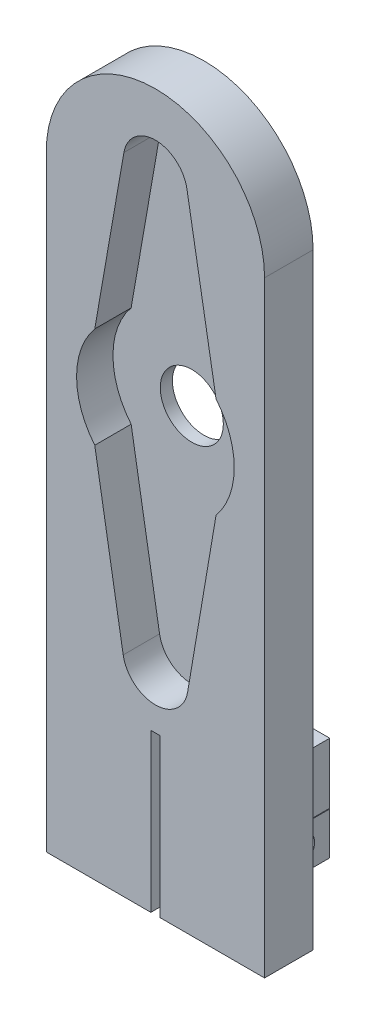
ISO-10303-21;
HEADER;
FILE_DESCRIPTION(('STEP AP214'),'2;1');
FILE_NAME('part.step','',(''),(''),'','','');
FILE_SCHEMA(('AUTOMOTIVE_DESIGN { 1 0 10303 214 1 1 1 1 }'));
ENDSEC;
DATA;
#1=APPLICATION_CONTEXT('core data for automotive mechanical design processes');
#2=APPLICATION_PROTOCOL_DEFINITION('international standard','automotive_design',2000,#1);
#3=PRODUCT_CONTEXT('',#1,'mechanical');
#4=PRODUCT('Part','Part','',(#3));
#5=PRODUCT_RELATED_PRODUCT_CATEGORY('part','',(#4));
#6=PRODUCT_DEFINITION_FORMATION('','',#4);
#7=PRODUCT_DEFINITION_CONTEXT('part definition',#1,'design');
#8=PRODUCT_DEFINITION('design','',#6,#7);
#9=PRODUCT_DEFINITION_SHAPE('','',#8);
#10=(LENGTH_UNIT() NAMED_UNIT(*) SI_UNIT(.MILLI.,.METRE.));
#11=(NAMED_UNIT(*) PLANE_ANGLE_UNIT() SI_UNIT($,.RADIAN.));
#12=(NAMED_UNIT(*) SI_UNIT($,.STERADIAN.) SOLID_ANGLE_UNIT());
#13=UNCERTAINTY_MEASURE_WITH_UNIT(LENGTH_MEASURE(1.E-05),#10,'distance_accuracy_value','');
#14=(GEOMETRIC_REPRESENTATION_CONTEXT(3) GLOBAL_UNCERTAINTY_ASSIGNED_CONTEXT((#13)) GLOBAL_UNIT_ASSIGNED_CONTEXT((#10,
#11,#12)) REPRESENTATION_CONTEXT('',''));
#15=CARTESIAN_POINT('',(0.,0.,0.));
#16=DIRECTION('',(0.,0.,1.));
#17=DIRECTION('',(1.,0.,0.));
#18=AXIS2_PLACEMENT_3D('',#15,#16,#17);
#19=CARTESIAN_POINT('',(0.,50.,0.));
#20=DIRECTION('',(0.,0.,-1.));
#21=DIRECTION('',(-1.,0.,0.));
#22=AXIS2_PLACEMENT_3D('',#19,#20,#21);
#23=PLANE('',#22);
#24=CARTESIAN_POINT('',(0.,34.8563142161993,0.));
#25=DIRECTION('',(0.,0.,-1.));
#26=DIRECTION('',(-1.,0.,0.));
#27=AXIS2_PLACEMENT_3D('',#24,#25,#26);
#28=CIRCLE('',#27,2.6);
#29=CARTESIAN_POINT('',(-2.6,34.8563142161993,0.));
#30=VERTEX_POINT('',#29);
#31=EDGE_CURVE('E299',#30,#30,#28,.F.);
#32=ORIENTED_EDGE('',*,*,#31,.T.);
#33=EDGE_LOOP('',(#32));
#34=FACE_BOUND('',#33,.T.);
#35=DIRECTION('',(0.,1.,0.));
#36=VECTOR('',#35,1.);
#37=CARTESIAN_POINT('',(0.375,0.,0.));
#38=LINE('',#37,#36);
#39=CARTESIAN_POINT('',(0.375,0.,0.));
#40=VERTEX_POINT('',#39);
#41=CARTESIAN_POINT('',(0.375,2.2621640661949,0.));
#42=VERTEX_POINT('',#41);
#43=EDGE_CURVE('E281',#40,#42,#38,.T.);
#44=ORIENTED_EDGE('',*,*,#43,.T.);
#45=DIRECTION('',(-1.,0.,0.));
#46=VECTOR('',#45,1.);
#47=CARTESIAN_POINT('',(5.375,2.2621640661949,0.));
#48=LINE('',#47,#46);
#49=CARTESIAN_POINT('',(5.375,2.2621640661949,0.));
#50=VERTEX_POINT('',#49);
#51=EDGE_CURVE('E55',#50,#42,#48,.T.);
#52=ORIENTED_EDGE('',*,*,#51,.F.);
#53=DIRECTION('',(0.,-1.,0.));
#54=VECTOR('',#53,1.);
#55=CARTESIAN_POINT('',(5.375,5.7621640661949,0.));
#56=LINE('',#55,#54);
#57=CARTESIAN_POINT('',(5.375,5.7621640661949,0.));
#58=VERTEX_POINT('',#57);
#59=EDGE_CURVE('E60',#58,#50,#56,.T.);
#60=ORIENTED_EDGE('',*,*,#59,.F.);
#61=DIRECTION('',(-1.,0.,0.));
#62=VECTOR('',#61,1.);
#63=CARTESIAN_POINT('',(5.375,5.7621640661949,0.));
#64=LINE('',#63,#62);
#65=CARTESIAN_POINT('',(0.375,5.7621640661949,0.));
#66=VERTEX_POINT('',#65);
#67=EDGE_CURVE('E222',#58,#66,#64,.T.);
#68=ORIENTED_EDGE('',*,*,#67,.T.);
#69=CARTESIAN_POINT('',(0.375,5.81216406619489,0.));
#70=VERTEX_POINT('',#69);
#71=EDGE_CURVE('E284',#66,#70,#38,.T.);
#72=ORIENTED_EDGE('',*,*,#71,.T.);
#73=DIRECTION('',(1.,0.,0.));
#74=VECTOR('',#73,1.);
#75=CARTESIAN_POINT('',(5.375,5.8121640661949,0.));
#76=LINE('',#75,#74);
#77=CARTESIAN_POINT('',(5.375,5.8121640661949,0.));
#78=VERTEX_POINT('',#77);
#79=EDGE_CURVE('E244',#70,#78,#76,.T.);
#80=ORIENTED_EDGE('',*,*,#79,.T.);
#81=DIRECTION('',(0.,1.,0.));
#82=VECTOR('',#81,1.);
#83=CARTESIAN_POINT('',(5.375,10.8121640661949,0.));
#84=LINE('',#83,#82);
#85=CARTESIAN_POINT('',(5.375,10.8121640661949,0.));
#86=VERTEX_POINT('',#85);
#87=EDGE_CURVE('E239',#78,#86,#84,.T.);
#88=ORIENTED_EDGE('',*,*,#87,.T.);
#89=DIRECTION('',(-1.,0.,0.));
#90=VECTOR('',#89,1.);
#91=CARTESIAN_POINT('',(5.375,10.8121640661949,0.));
#92=LINE('',#91,#90);
#93=CARTESIAN_POINT('',(0.375,10.8121640661949,0.));
#94=VERTEX_POINT('',#93);
#95=EDGE_CURVE('E256',#86,#94,#92,.T.);
#96=ORIENTED_EDGE('',*,*,#95,.T.);
#97=CARTESIAN_POINT('',(0.375,13.,0.));
#98=VERTEX_POINT('',#97);
#99=EDGE_CURVE('E264',#94,#98,#38,.T.);
#100=ORIENTED_EDGE('',*,*,#99,.T.);
#101=DIRECTION('',(1.,0.,0.));
#102=VECTOR('',#101,1.);
#103=CARTESIAN_POINT('',(-0.375,13.,0.));
#104=LINE('',#103,#102);
#105=CARTESIAN_POINT('',(-0.375,13.,0.));
#106=VERTEX_POINT('',#105);
#107=EDGE_CURVE('E283',#106,#98,#104,.T.);
#108=ORIENTED_EDGE('',*,*,#107,.F.);
#109=DIRECTION('',(0.,1.,0.));
#110=VECTOR('',#109,1.);
#111=CARTESIAN_POINT('',(-0.375,0.,0.));
#112=LINE('',#111,#110);
#113=CARTESIAN_POINT('',(-0.375,0.,0.));
#114=VERTEX_POINT('',#113);
#115=EDGE_CURVE('E274',#114,#106,#112,.T.);
#116=ORIENTED_EDGE('',*,*,#115,.F.);
#117=DIRECTION('',(1.,0.,0.));
#118=VECTOR('',#117,1.);
#119=CARTESIAN_POINT('',(-9.,0.,0.));
#120=LINE('',#119,#118);
#121=CARTESIAN_POINT('',(-9.,0.,0.));
#122=VERTEX_POINT('',#121);
#123=EDGE_CURVE('E378',#122,#114,#120,.T.);
#124=ORIENTED_EDGE('',*,*,#123,.F.);
#125=DIRECTION('',(0.,1.,0.));
#126=VECTOR('',#125,1.);
#127=CARTESIAN_POINT('',(-9.,0.,0.));
#128=LINE('',#127,#126);
#129=CARTESIAN_POINT('',(-8.99999999999999,50.,0.));
#130=VERTEX_POINT('',#129);
#131=EDGE_CURVE('E387',#122,#130,#128,.T.);
#132=ORIENTED_EDGE('',*,*,#131,.T.);
#133=CARTESIAN_POINT('',(0.,50.,0.));
#134=DIRECTION('',(0.,0.,-1.));
#135=DIRECTION('',(-1.,0.,0.));
#136=AXIS2_PLACEMENT_3D('',#133,#134,#135);
#137=CIRCLE('',#136,8.99999999999999);
#138=CARTESIAN_POINT('',(8.99999999999999,50.,0.));
#139=VERTEX_POINT('',#138);
#140=EDGE_CURVE('E384',#130,#139,#137,.T.);
#141=ORIENTED_EDGE('',*,*,#140,.T.);
#142=DIRECTION('',(0.,1.,0.));
#143=VECTOR('',#142,1.);
#144=CARTESIAN_POINT('',(9.,0.,0.));
#145=LINE('',#144,#143);
#146=CARTESIAN_POINT('',(9.,0.,0.));
#147=VERTEX_POINT('',#146);
#148=EDGE_CURVE('E381',#147,#139,#145,.T.);
#149=ORIENTED_EDGE('',*,*,#148,.F.);
#150=EDGE_CURVE('E350',#40,#147,#120,.T.);
#151=ORIENTED_EDGE('',*,*,#150,.F.);
#152=EDGE_LOOP('',(#44,#52,#60,#68,#72,#80,#88,#96,#100,#108,#116,#124,#132,#141,#149,#151));
#153=FACE_BOUND('',#152,.T.);
#154=ADVANCED_FACE('F38',(#34,#153),#23,.T.);
#155=CARTESIAN_POINT('',(-9.,0.,4.));
#156=DIRECTION('',(0.,1.,0.));
#157=DIRECTION('',(0.,0.,1.));
#158=AXIS2_PLACEMENT_3D('',#155,#156,#157);
#159=PLANE('',#158);
#160=DIRECTION('',(0.,0.,-1.));
#161=VECTOR('',#160,1.);
#162=CARTESIAN_POINT('',(0.375,0.,4.));
#163=LINE('',#162,#161);
#164=CARTESIAN_POINT('',(0.375,0.,4.));
#165=VERTEX_POINT('',#164);
#166=EDGE_CURVE('E295',#165,#40,#163,.T.);
#167=ORIENTED_EDGE('',*,*,#166,.T.);
#168=ORIENTED_EDGE('',*,*,#150,.T.);
#169=DIRECTION('',(0.,0.,-1.));
#170=VECTOR('',#169,1.);
#171=CARTESIAN_POINT('',(9.,0.,4.));
#172=LINE('',#171,#170);
#173=CARTESIAN_POINT('',(9.,0.,4.));
#174=VERTEX_POINT('',#173);
#175=EDGE_CURVE('E11',#174,#147,#172,.T.);
#176=ORIENTED_EDGE('',*,*,#175,.F.);
#177=DIRECTION('',(1.,0.,0.));
#178=VECTOR('',#177,1.);
#179=CARTESIAN_POINT('',(-9.,0.,4.));
#180=LINE('',#179,#178);
#181=EDGE_CURVE('E369',#165,#174,#180,.T.);
#182=ORIENTED_EDGE('',*,*,#181,.F.);
#183=EDGE_LOOP('',(#167,#168,#176,#182));
#184=FACE_BOUND('',#183,.T.);
#185=ADVANCED_FACE('F415',(#184),#159,.F.);
#186=CARTESIAN_POINT('',(0.,50.,4.));
#187=DIRECTION('',(0.,0.,-1.));
#188=DIRECTION('',(-1.,0.,0.));
#189=AXIS2_PLACEMENT_3D('',#186,#187,#188);
#190=PLANE('',#189);
#191=DIRECTION('',(0.171428571428572,-0.98519655140381,0.));
#192=VECTOR('',#191,1.);
#193=CARTESIAN_POINT('',(2.6,53.145110573231,4.));
#194=LINE('',#193,#192);
#195=CARTESIAN_POINT('',(2.6,53.145110573231,4.));
#196=VERTEX_POINT('',#195);
#197=CARTESIAN_POINT('',(5.,39.3523588535777,4.));
#198=VERTEX_POINT('',#197);
#199=EDGE_CURVE('E328',#196,#198,#194,.T.);
#200=ORIENTED_EDGE('',*,*,#199,.T.);
#201=CARTESIAN_POINT('',(0.,35.1990469221187,4.));
#202=DIRECTION('',(0.,0.,1.));
#203=DIRECTION('',(1.,0.,0.));
#204=AXIS2_PLACEMENT_3D('',#201,#202,#203);
#205=CIRCLE('',#204,6.5);
#206=CARTESIAN_POINT('',(5.,31.0457349906596,4.));
#207=VERTEX_POINT('',#206);
#208=EDGE_CURVE('E302',#207,#198,#205,.T.);
#209=ORIENTED_EDGE('',*,*,#208,.F.);
#210=DIRECTION('',(-0.167405247280844,-0.985888169714415,0.));
#211=VECTOR('',#210,1.);
#212=CARTESIAN_POINT('',(5.,31.0457349906596,4.));
#213=LINE('',#212,#211);
#214=CARTESIAN_POINT('',(2.65632653806819,17.2433006146578,4.));
#215=VERTEX_POINT('',#214);
#216=EDGE_CURVE('E307',#207,#215,#213,.T.);
#217=ORIENTED_EDGE('',*,*,#216,.T.);
#218=CARTESIAN_POINT('',(0.,17.6943487300772,4.));
#219=DIRECTION('',(0.,0.,1.));
#220=DIRECTION('',(1.,0.,0.));
#221=AXIS2_PLACEMENT_3D('',#218,#219,#220);
#222=CIRCLE('',#221,2.69434873007722);
#223=CARTESIAN_POINT('',(-2.65632653806819,17.2433006146578,4.));
#224=VERTEX_POINT('',#223);
#225=EDGE_CURVE('E343',#224,#215,#222,.T.);
#226=ORIENTED_EDGE('',*,*,#225,.F.);
#227=DIRECTION('',(0.167405247280844,-0.985888169714415,0.));
#228=VECTOR('',#227,1.);
#229=CARTESIAN_POINT('',(-5.,31.0457349906596,4.));
#230=LINE('',#229,#228);
#231=CARTESIAN_POINT('',(-5.,31.0457349906596,4.));
#232=VERTEX_POINT('',#231);
#233=EDGE_CURVE('E340',#232,#224,#230,.T.);
#234=ORIENTED_EDGE('',*,*,#233,.F.);
#235=CARTESIAN_POINT('',(0.,35.1990469221187,4.));
#236=DIRECTION('',(0.,0.,1.));
#237=DIRECTION('',(1.,0.,0.));
#238=AXIS2_PLACEMENT_3D('',#235,#236,#237);
#239=CIRCLE('',#238,6.5);
#240=CARTESIAN_POINT('',(-5.00000000000001,39.3523588535777,4.));
#241=VERTEX_POINT('',#240);
#242=EDGE_CURVE('E337',#241,#232,#239,.T.);
#243=ORIENTED_EDGE('',*,*,#242,.F.);
#244=DIRECTION('',(-0.171428571428572,-0.98519655140381,0.));
#245=VECTOR('',#244,1.);
#246=CARTESIAN_POINT('',(-2.6,53.145110573231,4.));
#247=LINE('',#246,#245);
#248=CARTESIAN_POINT('',(-2.6,53.145110573231,4.));
#249=VERTEX_POINT('',#248);
#250=EDGE_CURVE('E334',#249,#241,#247,.T.);
#251=ORIENTED_EDGE('',*,*,#250,.F.);
#252=CARTESIAN_POINT('',(0.,52.6926990365898,4.));
#253=DIRECTION('',(0.,0.,1.));
#254=DIRECTION('',(1.,0.,0.));
#255=AXIS2_PLACEMENT_3D('',#252,#253,#254);
#256=CIRCLE('',#255,2.63906729707413);
#257=EDGE_CURVE('E331',#196,#249,#256,.T.);
#258=ORIENTED_EDGE('',*,*,#257,.F.);
#259=EDGE_LOOP('',(#200,#209,#217,#226,#234,#243,#251,#258));
#260=FACE_BOUND('',#259,.T.);
#261=DIRECTION('',(0.,1.,0.));
#262=VECTOR('',#261,1.);
#263=CARTESIAN_POINT('',(0.375,0.,4.));
#264=LINE('',#263,#262);
#265=CARTESIAN_POINT('',(0.375,13.,4.));
#266=VERTEX_POINT('',#265);
#267=EDGE_CURVE('E271',#165,#266,#264,.T.);
#268=ORIENTED_EDGE('',*,*,#267,.F.);
#269=ORIENTED_EDGE('',*,*,#181,.T.);
#270=DIRECTION('',(0.,1.,0.));
#271=VECTOR('',#270,1.);
#272=CARTESIAN_POINT('',(9.,0.,4.));
#273=LINE('',#272,#271);
#274=CARTESIAN_POINT('',(8.99999999999999,50.,4.));
#275=VERTEX_POINT('',#274);
#276=EDGE_CURVE('E368',#174,#275,#273,.T.);
#277=ORIENTED_EDGE('',*,*,#276,.T.);
#278=CARTESIAN_POINT('',(0.,50.,4.));
#279=DIRECTION('',(0.,0.,-1.));
#280=DIRECTION('',(-1.,0.,0.));
#281=AXIS2_PLACEMENT_3D('',#278,#279,#280);
#282=CIRCLE('',#281,8.99999999999999);
#283=CARTESIAN_POINT('',(-8.99999999999999,50.,4.));
#284=VERTEX_POINT('',#283);
#285=EDGE_CURVE('E371',#284,#275,#282,.T.);
#286=ORIENTED_EDGE('',*,*,#285,.F.);
#287=DIRECTION('',(0.,1.,0.));
#288=VECTOR('',#287,1.);
#289=CARTESIAN_POINT('',(-9.,0.,4.));
#290=LINE('',#289,#288);
#291=CARTESIAN_POINT('',(-9.,0.,4.));
#292=VERTEX_POINT('',#291);
#293=EDGE_CURVE('E374',#292,#284,#290,.T.);
#294=ORIENTED_EDGE('',*,*,#293,.F.);
#295=CARTESIAN_POINT('',(-0.375,0.,4.));
#296=VERTEX_POINT('',#295);
#297=EDGE_CURVE('E365',#292,#296,#180,.T.);
#298=ORIENTED_EDGE('',*,*,#297,.T.);
#299=DIRECTION('',(0.,1.,0.));
#300=VECTOR('',#299,1.);
#301=CARTESIAN_POINT('',(-0.375,0.,4.));
#302=LINE('',#301,#300);
#303=CARTESIAN_POINT('',(-0.375,13.,4.));
#304=VERTEX_POINT('',#303);
#305=EDGE_CURVE('E277',#296,#304,#302,.T.);
#306=ORIENTED_EDGE('',*,*,#305,.T.);
#307=DIRECTION('',(1.,0.,0.));
#308=VECTOR('',#307,1.);
#309=CARTESIAN_POINT('',(-0.375,13.,4.));
#310=LINE('',#309,#308);
#311=EDGE_CURVE('E273',#304,#266,#310,.T.);
#312=ORIENTED_EDGE('',*,*,#311,.T.);
#313=EDGE_LOOP('',(#268,#269,#277,#286,#294,#298,#306,#312));
#314=FACE_BOUND('',#313,.T.);
#315=ADVANCED_FACE('F421',(#260,#314),#190,.F.);
#316=ORIENTED_EDGE('',*,*,#123,.T.);
#317=DIRECTION('',(0.,0.,-1.));
#318=VECTOR('',#317,1.);
#319=CARTESIAN_POINT('',(-0.375,0.,4.));
#320=LINE('',#319,#318);
#321=EDGE_CURVE('E280',#296,#114,#320,.T.);
#322=ORIENTED_EDGE('',*,*,#321,.F.);
#323=ORIENTED_EDGE('',*,*,#297,.F.);
#324=DIRECTION('',(0.,0.,-1.));
#325=VECTOR('',#324,1.);
#326=CARTESIAN_POINT('',(-9.,0.,4.));
#327=LINE('',#326,#325);
#328=EDGE_CURVE('E377',#292,#122,#327,.T.);
#329=ORIENTED_EDGE('',*,*,#328,.T.);
#330=EDGE_LOOP('',(#316,#322,#323,#329));
#331=FACE_BOUND('',#330,.T.);
#332=ADVANCED_FACE('F40',(#331),#159,.F.);
#333=CARTESIAN_POINT('',(9.,0.,4.));
#334=DIRECTION('',(-1.,0.,0.));
#335=DIRECTION('',(0.,-1.,0.));
#336=AXIS2_PLACEMENT_3D('',#333,#334,#335);
#337=PLANE('',#336);
#338=ORIENTED_EDGE('',*,*,#148,.T.);
#339=DIRECTION('',(0.,0.,-1.));
#340=VECTOR('',#339,1.);
#341=CARTESIAN_POINT('',(8.99999999999999,50.,4.));
#342=LINE('',#341,#340);
#343=EDGE_CURVE('E47',#275,#139,#342,.T.);
#344=ORIENTED_EDGE('',*,*,#343,.F.);
#345=ORIENTED_EDGE('',*,*,#276,.F.);
#346=ORIENTED_EDGE('',*,*,#175,.T.);
#347=EDGE_LOOP('',(#338,#344,#345,#346));
#348=FACE_BOUND('',#347,.T.);
#349=ADVANCED_FACE('F433',(#348),#337,.F.);
#350=CARTESIAN_POINT('',(0.,50.,4.));
#351=DIRECTION('',(0.,0.,-1.));
#352=DIRECTION('',(-1.,0.,0.));
#353=AXIS2_PLACEMENT_3D('',#350,#351,#352);
#354=CYLINDRICAL_SURFACE('',#353,8.99999999999999);
#355=ORIENTED_EDGE('',*,*,#140,.F.);
#356=DIRECTION('',(0.,0.,-1.));
#357=VECTOR('',#356,1.);
#358=CARTESIAN_POINT('',(-8.99999999999999,50.,4.));
#359=LINE('',#358,#357);
#360=EDGE_CURVE('E391',#284,#130,#359,.T.);
#361=ORIENTED_EDGE('',*,*,#360,.F.);
#362=ORIENTED_EDGE('',*,*,#285,.T.);
#363=ORIENTED_EDGE('',*,*,#343,.T.);
#364=EDGE_LOOP('',(#355,#361,#362,#363));
#365=FACE_BOUND('',#364,.T.);
#366=ADVANCED_FACE('F430',(#365),#354,.T.);
#367=CARTESIAN_POINT('',(-9.,0.,4.));
#368=DIRECTION('',(-1.,0.,0.));
#369=DIRECTION('',(0.,-1.,0.));
#370=AXIS2_PLACEMENT_3D('',#367,#368,#369);
#371=PLANE('',#370);
#372=ORIENTED_EDGE('',*,*,#131,.F.);
#373=ORIENTED_EDGE('',*,*,#328,.F.);
#374=ORIENTED_EDGE('',*,*,#293,.T.);
#375=ORIENTED_EDGE('',*,*,#360,.T.);
#376=EDGE_LOOP('',(#372,#373,#374,#375));
#377=FACE_BOUND('',#376,.T.);
#378=ADVANCED_FACE('F426',(#377),#371,.T.);
#379=CARTESIAN_POINT('',(0.,35.1990469221187,1.));
#380=DIRECTION('',(0.,0.,1.));
#381=DIRECTION('',(1.,0.,0.));
#382=AXIS2_PLACEMENT_3D('',#379,#380,#381);
#383=CYLINDRICAL_SURFACE('',#382,6.5);
#384=ORIENTED_EDGE('',*,*,#208,.T.);
#385=DIRECTION('',(0.,0.,1.));
#386=VECTOR('',#385,1.);
#387=CARTESIAN_POINT('',(5.,39.3523588535777,1.));
#388=LINE('',#387,#386);
#389=CARTESIAN_POINT('',(5.,39.3523588535777,1.));
#390=VERTEX_POINT('',#389);
#391=EDGE_CURVE('E326',#390,#198,#388,.T.);
#392=ORIENTED_EDGE('',*,*,#391,.F.);
#393=CARTESIAN_POINT('',(0.,35.1990469221187,1.));
#394=DIRECTION('',(0.,0.,1.));
#395=DIRECTION('',(1.,0.,0.));
#396=AXIS2_PLACEMENT_3D('',#393,#394,#395);
#397=CIRCLE('',#396,6.5);
#398=CARTESIAN_POINT('',(5.,31.0457349906596,1.));
#399=VERTEX_POINT('',#398);
#400=EDGE_CURVE('E303',#399,#390,#397,.T.);
#401=ORIENTED_EDGE('',*,*,#400,.F.);
#402=DIRECTION('',(0.,0.,1.));
#403=VECTOR('',#402,1.);
#404=CARTESIAN_POINT('',(5.,31.0457349906596,1.));
#405=LINE('',#404,#403);
#406=EDGE_CURVE('E348',#399,#207,#405,.T.);
#407=ORIENTED_EDGE('',*,*,#406,.T.);
#408=EDGE_LOOP('',(#384,#392,#401,#407));
#409=FACE_BOUND('',#408,.T.);
#410=ADVANCED_FACE('F429',(#409),#383,.F.);
#411=CARTESIAN_POINT('',(5.,31.0457349906596,1.));
#412=DIRECTION('',(-0.985888169714415,0.167405247280844,0.));
#413=DIRECTION('',(-0.167405247280844,-0.985888169714415,0.));
#414=AXIS2_PLACEMENT_3D('',#411,#412,#413);
#415=PLANE('',#414);
#416=ORIENTED_EDGE('',*,*,#216,.F.);
#417=ORIENTED_EDGE('',*,*,#406,.F.);
#418=DIRECTION('',(-0.167405247280844,-0.985888169714415,0.));
#419=VECTOR('',#418,1.);
#420=CARTESIAN_POINT('',(5.,31.0457349906596,1.));
#421=LINE('',#420,#419);
#422=CARTESIAN_POINT('',(2.65632653806819,17.2433006146578,1.));
#423=VERTEX_POINT('',#422);
#424=EDGE_CURVE('E324',#399,#423,#421,.T.);
#425=ORIENTED_EDGE('',*,*,#424,.T.);
#426=DIRECTION('',(0.,0.,1.));
#427=VECTOR('',#426,1.);
#428=CARTESIAN_POINT('',(2.65632653806819,17.2433006146578,1.));
#429=LINE('',#428,#427);
#430=EDGE_CURVE('E351',#423,#215,#429,.T.);
#431=ORIENTED_EDGE('',*,*,#430,.T.);
#432=EDGE_LOOP('',(#416,#417,#425,#431));
#433=FACE_BOUND('',#432,.T.);
#434=ADVANCED_FACE('F674',(#433),#415,.T.);
#435=CARTESIAN_POINT('',(0.,17.6943487300772,1.));
#436=DIRECTION('',(0.,0.,1.));
#437=DIRECTION('',(1.,0.,0.));
#438=AXIS2_PLACEMENT_3D('',#435,#436,#437);
#439=CYLINDRICAL_SURFACE('',#438,2.69434873007722);
#440=ORIENTED_EDGE('',*,*,#225,.T.);
#441=ORIENTED_EDGE('',*,*,#430,.F.);
#442=CARTESIAN_POINT('',(0.,17.6943487300772,1.));
#443=DIRECTION('',(0.,0.,1.));
#444=DIRECTION('',(1.,0.,0.));
#445=AXIS2_PLACEMENT_3D('',#442,#443,#444);
#446=CIRCLE('',#445,2.69434873007722);
#447=CARTESIAN_POINT('',(-2.65632653806819,17.2433006146578,1.));
#448=VERTEX_POINT('',#447);
#449=EDGE_CURVE('E321',#448,#423,#446,.T.);
#450=ORIENTED_EDGE('',*,*,#449,.F.);
#451=DIRECTION('',(0.,0.,1.));
#452=VECTOR('',#451,1.);
#453=CARTESIAN_POINT('',(-2.65632653806819,17.2433006146578,1.));
#454=LINE('',#453,#452);
#455=EDGE_CURVE('E353',#448,#224,#454,.T.);
#456=ORIENTED_EDGE('',*,*,#455,.T.);
#457=EDGE_LOOP('',(#440,#441,#450,#456));
#458=FACE_BOUND('',#457,.T.);
#459=ADVANCED_FACE('F665',(#458),#439,.F.);
#460=CARTESIAN_POINT('',(-5.,31.0457349906596,1.));
#461=DIRECTION('',(-0.985888169714415,-0.167405247280844,0.));
#462=DIRECTION('',(0.167405247280844,-0.985888169714415,0.));
#463=AXIS2_PLACEMENT_3D('',#460,#461,#462);
#464=PLANE('',#463);
#465=ORIENTED_EDGE('',*,*,#233,.T.);
#466=ORIENTED_EDGE('',*,*,#455,.F.);
#467=DIRECTION('',(0.167405247280844,-0.985888169714415,0.));
#468=VECTOR('',#467,1.);
#469=CARTESIAN_POINT('',(-5.,31.0457349906596,1.));
#470=LINE('',#469,#468);
#471=CARTESIAN_POINT('',(-5.,31.0457349906596,1.));
#472=VERTEX_POINT('',#471);
#473=EDGE_CURVE('E318',#472,#448,#470,.T.);
#474=ORIENTED_EDGE('',*,*,#473,.F.);
#475=DIRECTION('',(0.,0.,1.));
#476=VECTOR('',#475,1.);
#477=CARTESIAN_POINT('',(-5.,31.0457349906596,1.));
#478=LINE('',#477,#476);
#479=EDGE_CURVE('E355',#472,#232,#478,.T.);
#480=ORIENTED_EDGE('',*,*,#479,.T.);
#481=EDGE_LOOP('',(#465,#466,#474,#480));
#482=FACE_BOUND('',#481,.T.);
#483=ADVANCED_FACE('F656',(#482),#464,.F.);
#484=CARTESIAN_POINT('',(0.,35.1990469221187,1.));
#485=DIRECTION('',(0.,0.,1.));
#486=DIRECTION('',(1.,0.,0.));
#487=AXIS2_PLACEMENT_3D('',#484,#485,#486);
#488=CYLINDRICAL_SURFACE('',#487,6.5);
#489=ORIENTED_EDGE('',*,*,#242,.T.);
#490=ORIENTED_EDGE('',*,*,#479,.F.);
#491=CARTESIAN_POINT('',(0.,35.1990469221187,1.));
#492=DIRECTION('',(0.,0.,1.));
#493=DIRECTION('',(1.,0.,0.));
#494=AXIS2_PLACEMENT_3D('',#491,#492,#493);
#495=CIRCLE('',#494,6.5);
#496=CARTESIAN_POINT('',(-5.00000000000001,39.3523588535777,1.));
#497=VERTEX_POINT('',#496);
#498=EDGE_CURVE('E315',#497,#472,#495,.T.);
#499=ORIENTED_EDGE('',*,*,#498,.F.);
#500=DIRECTION('',(0.,0.,1.));
#501=VECTOR('',#500,1.);
#502=CARTESIAN_POINT('',(-5.00000000000001,39.3523588535777,1.));
#503=LINE('',#502,#501);
#504=EDGE_CURVE('E357',#497,#241,#503,.T.);
#505=ORIENTED_EDGE('',*,*,#504,.T.);
#506=EDGE_LOOP('',(#489,#490,#499,#505));
#507=FACE_BOUND('',#506,.T.);
#508=ADVANCED_FACE('F647',(#507),#488,.F.);
#509=CARTESIAN_POINT('',(-2.6,53.145110573231,1.));
#510=DIRECTION('',(-0.985196551403809,0.171428571428572,0.));
#511=DIRECTION('',(-0.171428571428572,-0.98519655140381,0.));
#512=AXIS2_PLACEMENT_3D('',#509,#510,#511);
#513=PLANE('',#512);
#514=ORIENTED_EDGE('',*,*,#250,.T.);
#515=ORIENTED_EDGE('',*,*,#504,.F.);
#516=DIRECTION('',(-0.171428571428572,-0.98519655140381,0.));
#517=VECTOR('',#516,1.);
#518=CARTESIAN_POINT('',(-2.6,53.145110573231,1.));
#519=LINE('',#518,#517);
#520=CARTESIAN_POINT('',(-2.6,53.145110573231,1.));
#521=VERTEX_POINT('',#520);
#522=EDGE_CURVE('E312',#521,#497,#519,.T.);
#523=ORIENTED_EDGE('',*,*,#522,.F.);
#524=DIRECTION('',(0.,0.,1.));
#525=VECTOR('',#524,1.);
#526=CARTESIAN_POINT('',(-2.6,53.145110573231,1.));
#527=LINE('',#526,#525);
#528=EDGE_CURVE('E359',#521,#249,#527,.T.);
#529=ORIENTED_EDGE('',*,*,#528,.T.);
#530=EDGE_LOOP('',(#514,#515,#523,#529));
#531=FACE_BOUND('',#530,.T.);
#532=ADVANCED_FACE('F638',(#531),#513,.F.);
#533=CARTESIAN_POINT('',(0.,52.6926990365898,1.));
#534=DIRECTION('',(0.,0.,1.));
#535=DIRECTION('',(1.,0.,0.));
#536=AXIS2_PLACEMENT_3D('',#533,#534,#535);
#537=CYLINDRICAL_SURFACE('',#536,2.63906729707413);
#538=ORIENTED_EDGE('',*,*,#257,.T.);
#539=ORIENTED_EDGE('',*,*,#528,.F.);
#540=CARTESIAN_POINT('',(0.,52.6926990365898,1.));
#541=DIRECTION('',(0.,0.,1.));
#542=DIRECTION('',(1.,0.,0.));
#543=AXIS2_PLACEMENT_3D('',#540,#541,#542);
#544=CIRCLE('',#543,2.63906729707413);
#545=CARTESIAN_POINT('',(2.6,53.145110573231,1.));
#546=VERTEX_POINT('',#545);
#547=EDGE_CURVE('E309',#546,#521,#544,.T.);
#548=ORIENTED_EDGE('',*,*,#547,.F.);
#549=DIRECTION('',(0.,0.,1.));
#550=VECTOR('',#549,1.);
#551=CARTESIAN_POINT('',(2.6,53.145110573231,1.));
#552=LINE('',#551,#550);
#553=EDGE_CURVE('E361',#546,#196,#552,.T.);
#554=ORIENTED_EDGE('',*,*,#553,.T.);
#555=EDGE_LOOP('',(#538,#539,#548,#554));
#556=FACE_BOUND('',#555,.T.);
#557=ADVANCED_FACE('F629',(#556),#537,.F.);
#558=CARTESIAN_POINT('',(2.6,53.145110573231,1.));
#559=DIRECTION('',(-0.985196551403809,-0.171428571428572,0.));
#560=DIRECTION('',(0.171428571428572,-0.98519655140381,0.));
#561=AXIS2_PLACEMENT_3D('',#558,#559,#560);
#562=PLANE('',#561);
#563=ORIENTED_EDGE('',*,*,#199,.F.);
#564=ORIENTED_EDGE('',*,*,#553,.F.);
#565=DIRECTION('',(0.171428571428572,-0.98519655140381,0.));
#566=VECTOR('',#565,1.);
#567=CARTESIAN_POINT('',(2.6,53.145110573231,1.));
#568=LINE('',#567,#566);
#569=EDGE_CURVE('E306',#546,#390,#568,.T.);
#570=ORIENTED_EDGE('',*,*,#569,.T.);
#571=ORIENTED_EDGE('',*,*,#391,.T.);
#572=EDGE_LOOP('',(#563,#564,#570,#571));
#573=FACE_BOUND('',#572,.T.);
#574=ADVANCED_FACE('F411',(#573),#562,.T.);
#575=CARTESIAN_POINT('',(0.,35.1990469221187,1.));
#576=DIRECTION('',(0.,0.,1.));
#577=DIRECTION('',(1.,0.,0.));
#578=AXIS2_PLACEMENT_3D('',#575,#576,#577);
#579=PLANE('',#578);
#580=CARTESIAN_POINT('',(0.,34.8563142161993,1.));
#581=DIRECTION('',(0.,0.,1.));
#582=DIRECTION('',(1.,0.,0.));
#583=AXIS2_PLACEMENT_3D('',#580,#581,#582);
#584=CIRCLE('',#583,2.6);
#585=CARTESIAN_POINT('',(2.6,34.8563142161993,1.));
#586=VERTEX_POINT('',#585);
#587=EDGE_CURVE('E298',#586,#586,#584,.F.);
#588=ORIENTED_EDGE('',*,*,#587,.T.);
#589=EDGE_LOOP('',(#588));
#590=FACE_BOUND('',#589,.T.);
#591=ORIENTED_EDGE('',*,*,#400,.T.);
#592=ORIENTED_EDGE('',*,*,#569,.F.);
#593=ORIENTED_EDGE('',*,*,#547,.T.);
#594=ORIENTED_EDGE('',*,*,#522,.T.);
#595=ORIENTED_EDGE('',*,*,#498,.T.);
#596=ORIENTED_EDGE('',*,*,#473,.T.);
#597=ORIENTED_EDGE('',*,*,#449,.T.);
#598=ORIENTED_EDGE('',*,*,#424,.F.);
#599=EDGE_LOOP('',(#591,#592,#593,#594,#595,#596,#597,#598));
#600=FACE_BOUND('',#599,.T.);
#601=ADVANCED_FACE('F396',(#590,#600),#579,.T.);
#602=CARTESIAN_POINT('',(0.,34.8563142161993,19.));
#603=DIRECTION('',(0.,0.,-1.));
#604=DIRECTION('',(-1.,0.,0.));
#605=AXIS2_PLACEMENT_3D('',#602,#603,#604);
#606=CYLINDRICAL_SURFACE('',#605,2.6);
#607=ORIENTED_EDGE('',*,*,#31,.F.);
#608=EDGE_LOOP('',(#607));
#609=FACE_BOUND('',#608,.T.);
#610=ORIENTED_EDGE('',*,*,#587,.F.);
#611=EDGE_LOOP('',(#610));
#612=FACE_BOUND('',#611,.T.);
#613=ADVANCED_FACE('F399',(#609,#612),#606,.F.);
#614=CARTESIAN_POINT('',(0.375,0.,4.));
#615=DIRECTION('',(-1.,0.,0.));
#616=DIRECTION('',(0.,0.,1.));
#617=AXIS2_PLACEMENT_3D('',#614,#615,#616);
#618=PLANE('',#617);
#619=CARTESIAN_POINT('',(0.375,8.3121640661949,-2.37977475634449));
#620=DIRECTION('',(-1.,0.,0.));
#621=DIRECTION('',(0.,0.,1.));
#622=AXIS2_PLACEMENT_3D('',#619,#620,#621);
#623=CIRCLE('',#622,1.25);
#624=CARTESIAN_POINT('',(0.375,8.3121640661949,-1.12977475634449));
#625=VERTEX_POINT('',#624);
#626=EDGE_CURVE('E236',#625,#625,#623,.F.);
#627=ORIENTED_EDGE('',*,*,#626,.T.);
#628=EDGE_LOOP('',(#627));
#629=FACE_BOUND('',#628,.T.);
#630=ORIENTED_EDGE('',*,*,#43,.F.);
#631=ORIENTED_EDGE('',*,*,#166,.F.);
#632=ORIENTED_EDGE('',*,*,#267,.T.);
#633=DIRECTION('',(0.,0.,-1.));
#634=VECTOR('',#633,1.);
#635=CARTESIAN_POINT('',(0.375,13.,4.));
#636=LINE('',#635,#634);
#637=EDGE_CURVE('E292',#266,#98,#636,.T.);
#638=ORIENTED_EDGE('',*,*,#637,.T.);
#639=ORIENTED_EDGE('',*,*,#99,.F.);
#640=DIRECTION('',(0.,0.,1.));
#641=VECTOR('',#640,1.);
#642=CARTESIAN_POINT('',(0.375,10.8121640661949,-5.));
#643=LINE('',#642,#641);
#644=CARTESIAN_POINT('',(0.375,10.8121640661949,-5.));
#645=VERTEX_POINT('',#644);
#646=EDGE_CURVE('E268',#645,#94,#643,.T.);
#647=ORIENTED_EDGE('',*,*,#646,.F.);
#648=DIRECTION('',(0.,-1.,0.));
#649=VECTOR('',#648,1.);
#650=CARTESIAN_POINT('',(0.375,10.8121640661949,-5.));
#651=LINE('',#650,#649);
#652=CARTESIAN_POINT('',(0.375,5.81216406619489,-5.));
#653=VERTEX_POINT('',#652);
#654=EDGE_CURVE('E247',#645,#653,#651,.T.);
#655=ORIENTED_EDGE('',*,*,#654,.T.);
#656=DIRECTION('',(0.,0.,1.));
#657=VECTOR('',#656,1.);
#658=CARTESIAN_POINT('',(0.375,5.81216406619489,-5.));
#659=LINE('',#658,#657);
#660=EDGE_CURVE('E265',#653,#70,#659,.T.);
#661=ORIENTED_EDGE('',*,*,#660,.T.);
#662=ORIENTED_EDGE('',*,*,#71,.F.);
#663=DIRECTION('',(0.,0.,1.));
#664=VECTOR('',#663,1.);
#665=CARTESIAN_POINT('',(0.375,5.7621640661949,0.));
#666=LINE('',#665,#664);
#667=CARTESIAN_POINT('',(0.375,5.7621640661949,-5.));
#668=VERTEX_POINT('',#667);
#669=EDGE_CURVE('E230',#668,#66,#666,.T.);
#670=ORIENTED_EDGE('',*,*,#669,.F.);
#671=DIRECTION('',(0.,1.,0.));
#672=VECTOR('',#671,1.);
#673=CARTESIAN_POINT('',(0.375,5.7621640661949,-5.));
#674=LINE('',#673,#672);
#675=CARTESIAN_POINT('',(0.375,2.2621640661949,-5.));
#676=VERTEX_POINT('',#675);
#677=EDGE_CURVE('E227',#676,#668,#674,.T.);
#678=ORIENTED_EDGE('',*,*,#677,.F.);
#679=DIRECTION('',(0.,0.,-1.));
#680=VECTOR('',#679,1.);
#681=CARTESIAN_POINT('',(0.375,2.2621640661949,0.));
#682=LINE('',#681,#680);
#683=EDGE_CURVE('E212',#42,#676,#682,.T.);
#684=ORIENTED_EDGE('',*,*,#683,.F.);
#685=EDGE_LOOP('',(#630,#631,#632,#638,#639,#647,#655,#661,#662,#670,#678,#684));
#686=FACE_BOUND('',#685,.T.);
#687=CARTESIAN_POINT('',(0.375,4.0121640661949,-2.5));
#688=DIRECTION('',(1.,0.,0.));
#689=DIRECTION('',(0.,0.,-1.));
#690=AXIS2_PLACEMENT_3D('',#687,#688,#689);
#691=CIRCLE('',#690,1.25);
#692=CARTESIAN_POINT('',(0.375,4.0121640661949,-3.75));
#693=VERTEX_POINT('',#692);
#694=EDGE_CURVE('E747',#693,#693,#691,.T.);
#695=ORIENTED_EDGE('',*,*,#694,.T.);
#696=EDGE_LOOP('',(#695));
#697=FACE_BOUND('',#696,.T.);
#698=ADVANCED_FACE('F401',(#629,#686,#697),#618,.T.);
#699=CARTESIAN_POINT('',(-0.375,13.,4.));
#700=DIRECTION('',(0.,1.,0.));
#701=DIRECTION('',(0.,0.,1.));
#702=AXIS2_PLACEMENT_3D('',#699,#700,#701);
#703=PLANE('',#702);
#704=ORIENTED_EDGE('',*,*,#107,.T.);
#705=ORIENTED_EDGE('',*,*,#637,.F.);
#706=ORIENTED_EDGE('',*,*,#311,.F.);
#707=DIRECTION('',(0.,0.,-1.));
#708=VECTOR('',#707,1.);
#709=CARTESIAN_POINT('',(-0.375,13.,4.));
#710=LINE('',#709,#708);
#711=EDGE_CURVE('E290',#304,#106,#710,.T.);
#712=ORIENTED_EDGE('',*,*,#711,.T.);
#713=EDGE_LOOP('',(#704,#705,#706,#712));
#714=FACE_BOUND('',#713,.T.);
#715=ADVANCED_FACE('F408',(#714),#703,.F.);
#716=CARTESIAN_POINT('',(-0.375,0.,4.));
#717=DIRECTION('',(-1.,0.,0.));
#718=DIRECTION('',(0.,0.,1.));
#719=AXIS2_PLACEMENT_3D('',#716,#717,#718);
#720=PLANE('',#719);
#721=ORIENTED_EDGE('',*,*,#115,.T.);
#722=ORIENTED_EDGE('',*,*,#711,.F.);
#723=ORIENTED_EDGE('',*,*,#305,.F.);
#724=ORIENTED_EDGE('',*,*,#321,.T.);
#725=EDGE_LOOP('',(#721,#722,#723,#724));
#726=FACE_BOUND('',#725,.T.);
#727=ADVANCED_FACE('F457',(#726),#720,.F.);
#728=CARTESIAN_POINT('',(5.375,10.8121640661949,-5.));
#729=DIRECTION('',(1.,0.,0.));
#730=DIRECTION('',(0.,1.,0.));
#731=AXIS2_PLACEMENT_3D('',#728,#729,#730);
#732=PLANE('',#731);
#733=CARTESIAN_POINT('',(5.375,8.3121640661949,-2.37977475634449));
#734=DIRECTION('',(1.,0.,0.));
#735=DIRECTION('',(0.,1.,0.));
#736=AXIS2_PLACEMENT_3D('',#733,#734,#735);
#737=CIRCLE('',#736,1.25);
#738=CARTESIAN_POINT('',(5.375,9.56216406619489,-2.37977475634449));
#739=VERTEX_POINT('',#738);
#740=EDGE_CURVE('E42',#739,#739,#737,.F.);
#741=ORIENTED_EDGE('',*,*,#740,.T.);
#742=EDGE_LOOP('',(#741));
#743=FACE_BOUND('',#742,.T.);
#744=ORIENTED_EDGE('',*,*,#87,.F.);
#745=DIRECTION('',(0.,0.,1.));
#746=VECTOR('',#745,1.);
#747=CARTESIAN_POINT('',(5.375,5.8121640661949,-5.));
#748=LINE('',#747,#746);
#749=CARTESIAN_POINT('',(5.375,5.8121640661949,-5.));
#750=VERTEX_POINT('',#749);
#751=EDGE_CURVE('E261',#750,#78,#748,.T.);
#752=ORIENTED_EDGE('',*,*,#751,.F.);
#753=DIRECTION('',(0.,1.,0.));
#754=VECTOR('',#753,1.);
#755=CARTESIAN_POINT('',(5.375,10.8121640661949,-5.));
#756=LINE('',#755,#754);
#757=CARTESIAN_POINT('',(5.375,10.8121640661949,-5.));
#758=VERTEX_POINT('',#757);
#759=EDGE_CURVE('E240',#750,#758,#756,.T.);
#760=ORIENTED_EDGE('',*,*,#759,.T.);
#761=DIRECTION('',(0.,0.,1.));
#762=VECTOR('',#761,1.);
#763=CARTESIAN_POINT('',(5.375,10.8121640661949,-5.));
#764=LINE('',#763,#762);
#765=EDGE_CURVE('E253',#758,#86,#764,.T.);
#766=ORIENTED_EDGE('',*,*,#765,.T.);
#767=EDGE_LOOP('',(#744,#752,#760,#766));
#768=FACE_BOUND('',#767,.T.);
#769=ADVANCED_FACE('F477',(#743,#768),#732,.T.);
#770=CARTESIAN_POINT('',(5.375,5.8121640661949,-5.));
#771=DIRECTION('',(0.,-1.,0.));
#772=DIRECTION('',(1.,0.,0.));
#773=AXIS2_PLACEMENT_3D('',#770,#771,#772);
#774=PLANE('',#773);
#775=ORIENTED_EDGE('',*,*,#79,.F.);
#776=ORIENTED_EDGE('',*,*,#660,.F.);
#777=DIRECTION('',(1.,0.,0.));
#778=VECTOR('',#777,1.);
#779=CARTESIAN_POINT('',(5.375,5.8121640661949,-5.));
#780=LINE('',#779,#778);
#781=EDGE_CURVE('E250',#653,#750,#780,.T.);
#782=ORIENTED_EDGE('',*,*,#781,.T.);
#783=ORIENTED_EDGE('',*,*,#751,.T.);
#784=EDGE_LOOP('',(#775,#776,#782,#783));
#785=FACE_BOUND('',#784,.T.);
#786=ADVANCED_FACE('F474',(#785),#774,.T.);
#787=CARTESIAN_POINT('',(5.375,10.8121640661949,-5.));
#788=DIRECTION('',(0.,1.,0.));
#789=DIRECTION('',(0.,0.,1.));
#790=AXIS2_PLACEMENT_3D('',#787,#788,#789);
#791=PLANE('',#790);
#792=ORIENTED_EDGE('',*,*,#95,.F.);
#793=ORIENTED_EDGE('',*,*,#765,.F.);
#794=DIRECTION('',(-1.,0.,0.));
#795=VECTOR('',#794,1.);
#796=CARTESIAN_POINT('',(5.375,10.8121640661949,-5.));
#797=LINE('',#796,#795);
#798=EDGE_CURVE('E243',#758,#645,#797,.T.);
#799=ORIENTED_EDGE('',*,*,#798,.T.);
#800=ORIENTED_EDGE('',*,*,#646,.T.);
#801=EDGE_LOOP('',(#792,#793,#799,#800));
#802=FACE_BOUND('',#801,.T.);
#803=ADVANCED_FACE('F483',(#802),#791,.T.);
#804=CARTESIAN_POINT('',(0.,0.,-5.));
#805=DIRECTION('',(0.,0.,-1.));
#806=DIRECTION('',(-1.,0.,0.));
#807=AXIS2_PLACEMENT_3D('',#804,#805,#806);
#808=PLANE('',#807);
#809=ORIENTED_EDGE('',*,*,#759,.F.);
#810=ORIENTED_EDGE('',*,*,#781,.F.);
#811=ORIENTED_EDGE('',*,*,#654,.F.);
#812=ORIENTED_EDGE('',*,*,#798,.F.);
#813=EDGE_LOOP('',(#809,#810,#811,#812));
#814=FACE_BOUND('',#813,.T.);
#815=ADVANCED_FACE('F480',(#814),#808,.T.);
#816=CARTESIAN_POINT('',(39.,8.3121640661949,-2.37977475634449));
#817=DIRECTION('',(-1.,0.,0.));
#818=DIRECTION('',(0.,0.,1.));
#819=AXIS2_PLACEMENT_3D('',#816,#817,#818);
#820=CYLINDRICAL_SURFACE('',#819,1.25);
#821=ORIENTED_EDGE('',*,*,#626,.F.);
#822=EDGE_LOOP('',(#821));
#823=FACE_BOUND('',#822,.T.);
#824=ORIENTED_EDGE('',*,*,#740,.F.);
#825=EDGE_LOOP('',(#824));
#826=FACE_BOUND('',#825,.T.);
#827=ADVANCED_FACE('F490',(#823,#826),#820,.F.);
#828=CARTESIAN_POINT('',(5.375,0.,0.));
#829=DIRECTION('',(1.,0.,0.));
#830=DIRECTION('',(0.,0.,-1.));
#831=AXIS2_PLACEMENT_3D('',#828,#829,#830);
#832=PLANE('',#831);
#833=ORIENTED_EDGE('',*,*,#59,.T.);
#834=DIRECTION('',(0.,0.,-1.));
#835=VECTOR('',#834,1.);
#836=CARTESIAN_POINT('',(5.375,2.2621640661949,0.));
#837=LINE('',#836,#835);
#838=CARTESIAN_POINT('',(5.375,2.2621640661949,-5.));
#839=VERTEX_POINT('',#838);
#840=EDGE_CURVE('E199',#50,#839,#837,.T.);
#841=ORIENTED_EDGE('',*,*,#840,.T.);
#842=DIRECTION('',(0.,1.,0.));
#843=VECTOR('',#842,1.);
#844=CARTESIAN_POINT('',(5.375,5.7621640661949,-5.));
#845=LINE('',#844,#843);
#846=CARTESIAN_POINT('',(5.375,5.7621640661949,-5.));
#847=VERTEX_POINT('',#846);
#848=EDGE_CURVE('E204',#839,#847,#845,.T.);
#849=ORIENTED_EDGE('',*,*,#848,.T.);
#850=DIRECTION('',(0.,0.,1.));
#851=VECTOR('',#850,1.);
#852=CARTESIAN_POINT('',(5.375,5.7621640661949,0.));
#853=LINE('',#852,#851);
#854=EDGE_CURVE('E220',#847,#58,#853,.T.);
#855=ORIENTED_EDGE('',*,*,#854,.T.);
#856=EDGE_LOOP('',(#833,#841,#849,#855));
#857=FACE_BOUND('',#856,.T.);
#858=CARTESIAN_POINT('',(5.375,4.0121640661949,-2.5));
#859=DIRECTION('',(1.,0.,0.));
#860=DIRECTION('',(0.,0.,-1.));
#861=AXIS2_PLACEMENT_3D('',#858,#859,#860);
#862=CIRCLE('',#861,1.25);
#863=CARTESIAN_POINT('',(5.375,4.0121640661949,-3.75));
#864=VERTEX_POINT('',#863);
#865=EDGE_CURVE('E228',#864,#864,#862,.T.);
#866=ORIENTED_EDGE('',*,*,#865,.F.);
#867=EDGE_LOOP('',(#866));
#868=FACE_BOUND('',#867,.T.);
#869=ADVANCED_FACE('F201',(#857,#868),#832,.T.);
#870=CARTESIAN_POINT('',(5.375,2.2621640661949,0.));
#871=DIRECTION('',(0.,1.,0.));
#872=DIRECTION('',(0.,0.,1.));
#873=AXIS2_PLACEMENT_3D('',#870,#871,#872);
#874=PLANE('',#873);
#875=ORIENTED_EDGE('',*,*,#683,.T.);
#876=DIRECTION('',(-1.,0.,0.));
#877=VECTOR('',#876,1.);
#878=CARTESIAN_POINT('',(5.375,2.2621640661949,-5.));
#879=LINE('',#878,#877);
#880=EDGE_CURVE('E209',#839,#676,#879,.T.);
#881=ORIENTED_EDGE('',*,*,#880,.F.);
#882=ORIENTED_EDGE('',*,*,#840,.F.);
#883=ORIENTED_EDGE('',*,*,#51,.T.);
#884=EDGE_LOOP('',(#875,#881,#882,#883));
#885=FACE_BOUND('',#884,.T.);
#886=ADVANCED_FACE('F210',(#885),#874,.F.);
#887=CARTESIAN_POINT('',(5.375,5.7621640661949,-5.));
#888=DIRECTION('',(0.,0.,1.));
#889=DIRECTION('',(0.,-1.,0.));
#890=AXIS2_PLACEMENT_3D('',#887,#888,#889);
#891=PLANE('',#890);
#892=ORIENTED_EDGE('',*,*,#677,.T.);
#893=DIRECTION('',(-1.,0.,0.));
#894=VECTOR('',#893,1.);
#895=CARTESIAN_POINT('',(5.375,5.7621640661949,-5.));
#896=LINE('',#895,#894);
#897=EDGE_CURVE('E215',#847,#668,#896,.T.);
#898=ORIENTED_EDGE('',*,*,#897,.F.);
#899=ORIENTED_EDGE('',*,*,#848,.F.);
#900=ORIENTED_EDGE('',*,*,#880,.T.);
#901=EDGE_LOOP('',(#892,#898,#899,#900));
#902=FACE_BOUND('',#901,.T.);
#903=ADVANCED_FACE('F217',(#902),#891,.F.);
#904=CARTESIAN_POINT('',(5.375,5.7621640661949,0.));
#905=DIRECTION('',(0.,-1.,0.));
#906=DIRECTION('',(0.,0.,-1.));
#907=AXIS2_PLACEMENT_3D('',#904,#905,#906);
#908=PLANE('',#907);
#909=ORIENTED_EDGE('',*,*,#669,.T.);
#910=ORIENTED_EDGE('',*,*,#67,.F.);
#911=ORIENTED_EDGE('',*,*,#854,.F.);
#912=ORIENTED_EDGE('',*,*,#897,.T.);
#913=EDGE_LOOP('',(#909,#910,#911,#912));
#914=FACE_BOUND('',#913,.T.);
#915=ADVANCED_FACE('F468',(#914),#908,.F.);
#916=CARTESIAN_POINT('',(5.375,4.0121640661949,-2.5));
#917=DIRECTION('',(-1.,0.,0.));
#918=DIRECTION('',(0.,0.,1.));
#919=AXIS2_PLACEMENT_3D('',#916,#917,#918);
#920=CYLINDRICAL_SURFACE('',#919,1.25);
#921=ORIENTED_EDGE('',*,*,#865,.T.);
#922=EDGE_LOOP('',(#921));
#923=FACE_BOUND('',#922,.T.);
#924=ORIENTED_EDGE('',*,*,#694,.F.);
#925=EDGE_LOOP('',(#924));
#926=FACE_BOUND('',#925,.T.);
#927=ADVANCED_FACE('F560',(#923,#926),#920,.F.);
#928=CLOSED_SHELL('',(#154,#185,#315,#332,#349,#366,#378,#410,#434,#459,#483,#508,#532,#557,
#574,#601,#613,#698,#715,#727,#769,#786,#803,#815,#827,#869,#886,#903,#915,#927));
#929=MANIFOLD_SOLID_BREP('B2',#928);
#930=ADVANCED_BREP_SHAPE_REPRESENTATION('',(#18,#929),#14);
#931=SHAPE_DEFINITION_REPRESENTATION(#9,#930);
ENDSEC;
END-ISO-10303-21;
